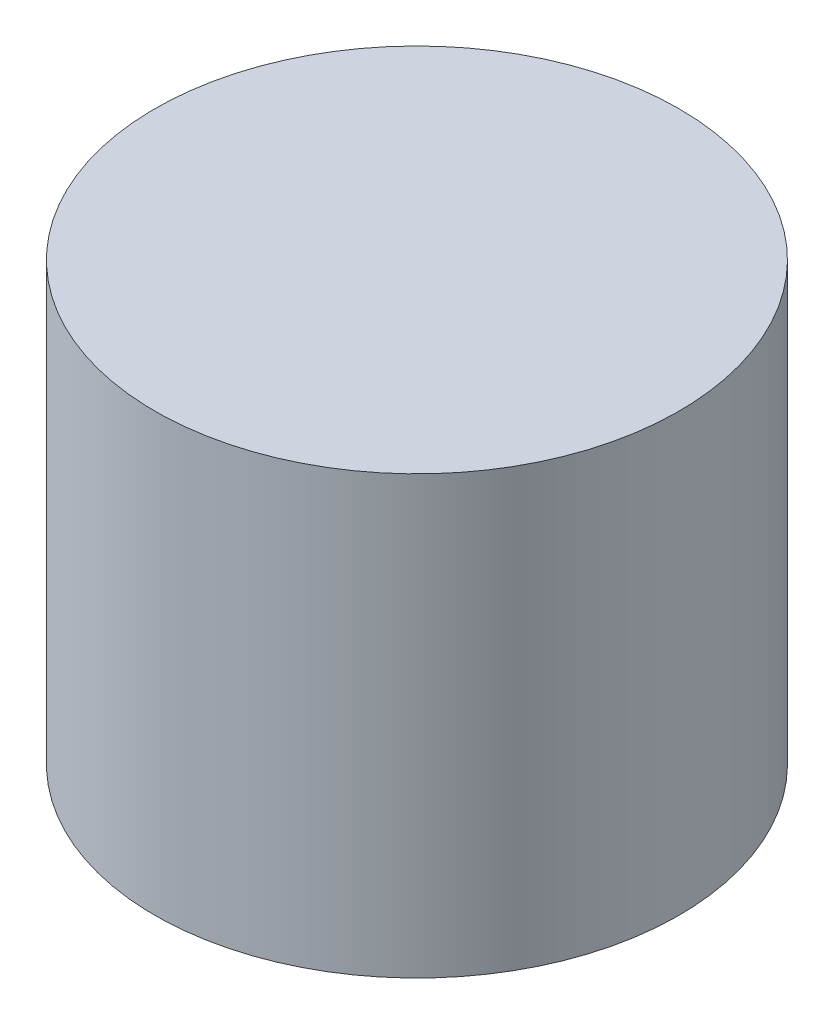
ISO-10303-21;
HEADER;
FILE_DESCRIPTION(('STEP AP214'),'2;1');
FILE_NAME('part.step','',(''),(''),'','','');
FILE_SCHEMA(('AUTOMOTIVE_DESIGN { 1 0 10303 214 1 1 1 1 }'));
ENDSEC;
DATA;
#1=APPLICATION_CONTEXT('core data for automotive mechanical design processes');
#2=APPLICATION_PROTOCOL_DEFINITION('international standard','automotive_design',2000,#1);
#3=PRODUCT_CONTEXT('',#1,'mechanical');
#4=PRODUCT('Part','Part','',(#3));
#5=PRODUCT_RELATED_PRODUCT_CATEGORY('part','',(#4));
#6=PRODUCT_DEFINITION_FORMATION('','',#4);
#7=PRODUCT_DEFINITION_CONTEXT('part definition',#1,'design');
#8=PRODUCT_DEFINITION('design','',#6,#7);
#9=PRODUCT_DEFINITION_SHAPE('','',#8);
#10=(LENGTH_UNIT() NAMED_UNIT(*) SI_UNIT(.MILLI.,.METRE.));
#11=(NAMED_UNIT(*) PLANE_ANGLE_UNIT() SI_UNIT($,.RADIAN.));
#12=(NAMED_UNIT(*) SI_UNIT($,.STERADIAN.) SOLID_ANGLE_UNIT());
#13=UNCERTAINTY_MEASURE_WITH_UNIT(LENGTH_MEASURE(1.E-05),#10,'distance_accuracy_value','');
#14=(GEOMETRIC_REPRESENTATION_CONTEXT(3) GLOBAL_UNCERTAINTY_ASSIGNED_CONTEXT((#13)) GLOBAL_UNIT_ASSIGNED_CONTEXT((#10,
#11,#12)) REPRESENTATION_CONTEXT('',''));
#15=CARTESIAN_POINT('',(0.,0.,0.));
#16=DIRECTION('',(0.,0.,1.));
#17=DIRECTION('',(1.,0.,0.));
#18=AXIS2_PLACEMENT_3D('',#15,#16,#17);
#19=CARTESIAN_POINT('',(0.,150.,0.));
#20=DIRECTION('',(0.,1.,0.));
#21=DIRECTION('',(0.,0.,1.));
#22=AXIS2_PLACEMENT_3D('',#19,#20,#21);
#23=PLANE('',#22);
#24=CARTESIAN_POINT('',(0.,150.,0.));
#25=DIRECTION('',(0.,-1.,0.));
#26=DIRECTION('',(0.,0.,-1.));
#27=AXIS2_PLACEMENT_3D('',#24,#25,#26);
#28=CIRCLE('',#27,90.);
#29=CARTESIAN_POINT('',(0.,150.,-90.));
#30=VERTEX_POINT('',#29);
#31=EDGE_CURVE('E12',#30,#30,#28,.T.);
#32=ORIENTED_EDGE('',*,*,#31,.F.);
#33=EDGE_LOOP('',(#32));
#34=FACE_BOUND('',#33,.T.);
#35=ADVANCED_FACE('F45',(#34),#23,.T.);
#36=CARTESIAN_POINT('',(0.,0.,0.));
#37=DIRECTION('',(0.,-1.,0.));
#38=DIRECTION('',(0.,0.,-1.));
#39=AXIS2_PLACEMENT_3D('',#36,#37,#38);
#40=CYLINDRICAL_SURFACE('',#39,90.);
#41=ORIENTED_EDGE('',*,*,#31,.T.);
#42=EDGE_LOOP('',(#41));
#43=FACE_BOUND('',#42,.T.);
#44=CARTESIAN_POINT('',(0.,0.,0.));
#45=DIRECTION('',(0.,-1.,0.));
#46=DIRECTION('',(0.,0.,-1.));
#47=AXIS2_PLACEMENT_3D('',#44,#45,#46);
#48=CIRCLE('',#47,90.);
#49=CARTESIAN_POINT('',(0.,0.,-90.));
#50=VERTEX_POINT('',#49);
#51=EDGE_CURVE('E51',#50,#50,#48,.T.);
#52=ORIENTED_EDGE('',*,*,#51,.F.);
#53=EDGE_LOOP('',(#52));
#54=FACE_BOUND('',#53,.T.);
#55=ADVANCED_FACE('F66',(#43,#54),#40,.T.);
#56=CARTESIAN_POINT('',(0.,0.,0.));
#57=DIRECTION('',(0.,-1.,0.));
#58=DIRECTION('',(0.,0.,-1.));
#59=AXIS2_PLACEMENT_3D('',#56,#57,#58);
#60=PLANE('',#59);
#61=CARTESIAN_POINT('',(0.,0.,0.));
#62=DIRECTION('',(0.,-1.,0.));
#63=DIRECTION('',(0.,0.,-1.));
#64=AXIS2_PLACEMENT_3D('',#61,#62,#63);
#65=CIRCLE('',#64,70.);
#66=CARTESIAN_POINT('',(0.,0.,-70.));
#67=VERTEX_POINT('',#66);
#68=EDGE_CURVE('E55',#67,#67,#65,.T.);
#69=ORIENTED_EDGE('',*,*,#68,.F.);
#70=EDGE_LOOP('',(#69));
#71=FACE_BOUND('',#70,.T.);
#72=ORIENTED_EDGE('',*,*,#51,.T.);
#73=EDGE_LOOP('',(#72));
#74=FACE_BOUND('',#73,.T.);
#75=ADVANCED_FACE('F64',(#71,#74),#60,.T.);
#76=CARTESIAN_POINT('',(0.,0.,0.));
#77=DIRECTION('',(0.,-1.,0.));
#78=DIRECTION('',(0.,0.,-1.));
#79=AXIS2_PLACEMENT_3D('',#76,#77,#78);
#80=SPHERICAL_SURFACE('',#79,70.);
#81=ORIENTED_EDGE('',*,*,#68,.T.);
#82=EDGE_LOOP('',(#81));
#83=FACE_BOUND('',#82,.T.);
#84=ADVANCED_FACE('F62',(#83),#80,.F.);
#85=CLOSED_SHELL('',(#35,#55,#75,#84));
#86=MANIFOLD_SOLID_BREP('B2',#85);
#87=ADVANCED_BREP_SHAPE_REPRESENTATION('',(#18,#86),#14);
#88=SHAPE_DEFINITION_REPRESENTATION(#9,#87);
ENDSEC;
END-ISO-10303-21;
